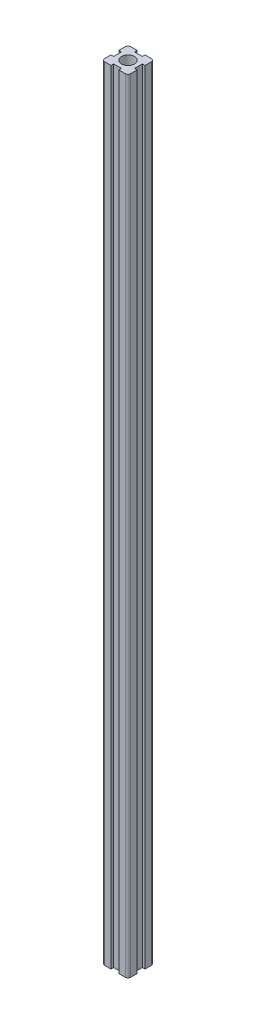
ISO-10303-21;
HEADER;
FILE_DESCRIPTION(('STEP AP214'),'2;1');
FILE_NAME('part.step','',(''),(''),'','','');
FILE_SCHEMA(('AUTOMOTIVE_DESIGN { 1 0 10303 214 1 1 1 1 }'));
ENDSEC;
DATA;
#1=APPLICATION_CONTEXT('core data for automotive mechanical design processes');
#2=APPLICATION_PROTOCOL_DEFINITION('international standard','automotive_design',2000,#1);
#3=PRODUCT_CONTEXT('',#1,'mechanical');
#4=PRODUCT('Part','Part','',(#3));
#5=PRODUCT_RELATED_PRODUCT_CATEGORY('part','',(#4));
#6=PRODUCT_DEFINITION_FORMATION('','',#4);
#7=PRODUCT_DEFINITION_CONTEXT('part definition',#1,'design');
#8=PRODUCT_DEFINITION('design','',#6,#7);
#9=PRODUCT_DEFINITION_SHAPE('','',#8);
#10=(LENGTH_UNIT() NAMED_UNIT(*) SI_UNIT(.MILLI.,.METRE.));
#11=(NAMED_UNIT(*) PLANE_ANGLE_UNIT() SI_UNIT($,.RADIAN.));
#12=(NAMED_UNIT(*) SI_UNIT($,.STERADIAN.) SOLID_ANGLE_UNIT());
#13=UNCERTAINTY_MEASURE_WITH_UNIT(LENGTH_MEASURE(1.E-05),#10,'distance_accuracy_value','');
#14=(GEOMETRIC_REPRESENTATION_CONTEXT(3) GLOBAL_UNCERTAINTY_ASSIGNED_CONTEXT((#13)) GLOBAL_UNIT_ASSIGNED_CONTEXT((#10,
#11,#12)) REPRESENTATION_CONTEXT('',''));
#15=CARTESIAN_POINT('',(0.,0.,0.));
#16=DIRECTION('',(0.,0.,1.));
#17=DIRECTION('',(1.,0.,0.));
#18=AXIS2_PLACEMENT_3D('',#15,#16,#17);
#19=CARTESIAN_POINT('',(10.,300.,-10.));
#20=DIRECTION('',(-1.,0.,0.));
#21=DIRECTION('',(0.,0.,1.));
#22=AXIS2_PLACEMENT_3D('',#19,#20,#21);
#23=PLANE('',#22);
#24=DIRECTION('',(0.,0.,-1.));
#25=VECTOR('',#24,1.);
#26=CARTESIAN_POINT('',(10.,-300.,-10.));
#27=LINE('',#26,#25);
#28=CARTESIAN_POINT('',(10.,-300.,-3.));
#29=VERTEX_POINT('',#28);
#30=CARTESIAN_POINT('',(10.,-300.,-8.00000000000001));
#31=VERTEX_POINT('',#30);
#32=EDGE_CURVE('E336',#29,#31,#27,.T.);
#33=ORIENTED_EDGE('',*,*,#32,.T.);
#34=DIRECTION('',(0.,-1.,0.));
#35=VECTOR('',#34,1.);
#36=CARTESIAN_POINT('',(10.,300.,-8.00000000000001));
#37=LINE('',#36,#35);
#38=CARTESIAN_POINT('',(10.,300.,-8.00000000000001));
#39=VERTEX_POINT('',#38);
#40=EDGE_CURVE('E435',#31,#39,#37,.F.);
#41=ORIENTED_EDGE('',*,*,#40,.T.);
#42=DIRECTION('',(0.,0.,-1.));
#43=VECTOR('',#42,1.);
#44=CARTESIAN_POINT('',(10.,300.,-10.));
#45=LINE('',#44,#43);
#46=CARTESIAN_POINT('',(10.,300.,-3.));
#47=VERTEX_POINT('',#46);
#48=EDGE_CURVE('E344',#47,#39,#45,.T.);
#49=ORIENTED_EDGE('',*,*,#48,.F.);
#50=DIRECTION('',(0.,-1.,0.));
#51=VECTOR('',#50,1.);
#52=CARTESIAN_POINT('',(10.,300.,-3.));
#53=LINE('',#52,#51);
#54=EDGE_CURVE('E397',#47,#29,#53,.T.);
#55=ORIENTED_EDGE('',*,*,#54,.T.);
#56=EDGE_LOOP('',(#33,#41,#49,#55));
#57=FACE_BOUND('',#56,.T.);
#58=ADVANCED_FACE('F39',(#57),#23,.F.);
#59=CARTESIAN_POINT('',(-9.99999999999998,300.,-10.));
#60=DIRECTION('',(0.,0.,1.));
#61=DIRECTION('',(1.,0.,0.));
#62=AXIS2_PLACEMENT_3D('',#59,#60,#61);
#63=PLANE('',#62);
#64=DIRECTION('',(-1.,0.,0.));
#65=VECTOR('',#64,1.);
#66=CARTESIAN_POINT('',(-9.99999999999998,300.,-10.));
#67=LINE('',#66,#65);
#68=CARTESIAN_POINT('',(8.00000000000001,300.,-10.));
#69=VERTEX_POINT('',#68);
#70=CARTESIAN_POINT('',(3.,300.,-10.));
#71=VERTEX_POINT('',#70);
#72=EDGE_CURVE('E345',#69,#71,#67,.T.);
#73=ORIENTED_EDGE('',*,*,#72,.F.);
#74=DIRECTION('',(0.,-1.,0.));
#75=VECTOR('',#74,1.);
#76=CARTESIAN_POINT('',(8.00000000000001,300.,-10.));
#77=LINE('',#76,#75);
#78=CARTESIAN_POINT('',(8.00000000000001,-300.,-10.));
#79=VERTEX_POINT('',#78);
#80=EDGE_CURVE('E431',#69,#79,#77,.T.);
#81=ORIENTED_EDGE('',*,*,#80,.T.);
#82=DIRECTION('',(-1.,0.,0.));
#83=VECTOR('',#82,1.);
#84=CARTESIAN_POINT('',(-9.99999999999998,-300.,-10.));
#85=LINE('',#84,#83);
#86=CARTESIAN_POINT('',(3.,-300.,-10.));
#87=VERTEX_POINT('',#86);
#88=EDGE_CURVE('E360',#79,#87,#85,.T.);
#89=ORIENTED_EDGE('',*,*,#88,.T.);
#90=DIRECTION('',(0.,1.,0.));
#91=VECTOR('',#90,1.);
#92=CARTESIAN_POINT('',(3.,300.,-10.));
#93=LINE('',#92,#91);
#94=EDGE_CURVE('E389',#87,#71,#93,.T.);
#95=ORIENTED_EDGE('',*,*,#94,.T.);
#96=EDGE_LOOP('',(#73,#81,#89,#95));
#97=FACE_BOUND('',#96,.T.);
#98=ADVANCED_FACE('F492',(#97),#63,.F.);
#99=CARTESIAN_POINT('',(-9.99999999999998,300.,-10.));
#100=DIRECTION('',(1.,0.,0.));
#101=DIRECTION('',(0.,0.,-1.));
#102=AXIS2_PLACEMENT_3D('',#99,#100,#101);
#103=PLANE('',#102);
#104=DIRECTION('',(0.,0.,1.));
#105=VECTOR('',#104,1.);
#106=CARTESIAN_POINT('',(-9.99999999999998,300.,-10.));
#107=LINE('',#106,#105);
#108=CARTESIAN_POINT('',(-9.99999999999998,300.,-8.00000000000001));
#109=VERTEX_POINT('',#108);
#110=CARTESIAN_POINT('',(-9.99999999999998,300.,-3.));
#111=VERTEX_POINT('',#110);
#112=EDGE_CURVE('E349',#109,#111,#107,.T.);
#113=ORIENTED_EDGE('',*,*,#112,.F.);
#114=DIRECTION('',(0.,-1.,0.));
#115=VECTOR('',#114,1.);
#116=CARTESIAN_POINT('',(-9.99999999999998,300.,-8.00000000000001));
#117=LINE('',#116,#115);
#118=CARTESIAN_POINT('',(-9.99999999999998,-300.,-8.00000000000001));
#119=VERTEX_POINT('',#118);
#120=EDGE_CURVE('E48',#109,#119,#117,.T.);
#121=ORIENTED_EDGE('',*,*,#120,.T.);
#122=DIRECTION('',(0.,0.,1.));
#123=VECTOR('',#122,1.);
#124=CARTESIAN_POINT('',(-9.99999999999998,-300.,-10.));
#125=LINE('',#124,#123);
#126=CARTESIAN_POINT('',(-9.99999999999998,-300.,-3.));
#127=VERTEX_POINT('',#126);
#128=EDGE_CURVE('E364',#119,#127,#125,.T.);
#129=ORIENTED_EDGE('',*,*,#128,.T.);
#130=DIRECTION('',(0.,1.,0.));
#131=VECTOR('',#130,1.);
#132=CARTESIAN_POINT('',(-9.99999999999998,300.,-3.));
#133=LINE('',#132,#131);
#134=EDGE_CURVE('E381',#127,#111,#133,.T.);
#135=ORIENTED_EDGE('',*,*,#134,.T.);
#136=EDGE_LOOP('',(#113,#121,#129,#135));
#137=FACE_BOUND('',#136,.T.);
#138=ADVANCED_FACE('F449',(#137),#103,.F.);
#139=CARTESIAN_POINT('',(-9.99999999999998,300.,10.));
#140=DIRECTION('',(0.,0.,-1.));
#141=DIRECTION('',(-1.,0.,0.));
#142=AXIS2_PLACEMENT_3D('',#139,#140,#141);
#143=PLANE('',#142);
#144=DIRECTION('',(1.,0.,0.));
#145=VECTOR('',#144,1.);
#146=CARTESIAN_POINT('',(-9.99999999999998,-300.,10.));
#147=LINE('',#146,#145);
#148=CARTESIAN_POINT('',(3.,-300.,10.));
#149=VERTEX_POINT('',#148);
#150=CARTESIAN_POINT('',(8.00000000000001,-300.,10.));
#151=VERTEX_POINT('',#150);
#152=EDGE_CURVE('E367',#149,#151,#147,.T.);
#153=ORIENTED_EDGE('',*,*,#152,.T.);
#154=DIRECTION('',(0.,-1.,0.));
#155=VECTOR('',#154,1.);
#156=CARTESIAN_POINT('',(8.00000000000001,300.,10.));
#157=LINE('',#156,#155);
#158=CARTESIAN_POINT('',(8.00000000000001,300.,10.));
#159=VERTEX_POINT('',#158);
#160=EDGE_CURVE('E417',#151,#159,#157,.F.);
#161=ORIENTED_EDGE('',*,*,#160,.T.);
#162=DIRECTION('',(1.,0.,0.));
#163=VECTOR('',#162,1.);
#164=CARTESIAN_POINT('',(-9.99999999999998,300.,10.));
#165=LINE('',#164,#163);
#166=CARTESIAN_POINT('',(3.,300.,10.));
#167=VERTEX_POINT('',#166);
#168=EDGE_CURVE('E352',#167,#159,#165,.T.);
#169=ORIENTED_EDGE('',*,*,#168,.F.);
#170=DIRECTION('',(0.,-1.,0.));
#171=VECTOR('',#170,1.);
#172=CARTESIAN_POINT('',(3.,300.,10.));
#173=LINE('',#172,#171);
#174=EDGE_CURVE('E373',#167,#149,#173,.T.);
#175=ORIENTED_EDGE('',*,*,#174,.T.);
#176=EDGE_LOOP('',(#153,#161,#169,#175));
#177=FACE_BOUND('',#176,.T.);
#178=ADVANCED_FACE('F544',(#177),#143,.F.);
#179=CARTESIAN_POINT('',(0.,300.,0.));
#180=DIRECTION('',(0.,1.,0.));
#181=DIRECTION('',(0.,0.,1.));
#182=AXIS2_PLACEMENT_3D('',#179,#180,#181);
#183=PLANE('',#182);
#184=ORIENTED_EDGE('',*,*,#168,.T.);
#185=CARTESIAN_POINT('',(8.00000000000001,300.,8.00000000000001));
#186=DIRECTION('',(0.,1.,0.));
#187=DIRECTION('',(0.,0.,1.));
#188=AXIS2_PLACEMENT_3D('',#185,#186,#187);
#189=CIRCLE('',#188,2.);
#190=CARTESIAN_POINT('',(10.,300.,8.00000000000001));
#191=VERTEX_POINT('',#190);
#192=EDGE_CURVE('E428',#159,#191,#189,.T.);
#193=ORIENTED_EDGE('',*,*,#192,.T.);
#194=CARTESIAN_POINT('',(10.,300.,3.));
#195=VERTEX_POINT('',#194);
#196=EDGE_CURVE('E340',#191,#195,#45,.T.);
#197=ORIENTED_EDGE('',*,*,#196,.T.);
#198=DIRECTION('',(-1.,0.,0.));
#199=VECTOR('',#198,1.);
#200=CARTESIAN_POINT('',(8.,300.,3.));
#201=LINE('',#200,#199);
#202=CARTESIAN_POINT('',(8.,300.,3.));
#203=VERTEX_POINT('',#202);
#204=EDGE_CURVE('E246',#195,#203,#201,.T.);
#205=ORIENTED_EDGE('',*,*,#204,.T.);
#206=DIRECTION('',(0.,0.,-1.));
#207=VECTOR('',#206,1.);
#208=CARTESIAN_POINT('',(8.,300.,3.));
#209=LINE('',#208,#207);
#210=CARTESIAN_POINT('',(8.,300.,-3.));
#211=VERTEX_POINT('',#210);
#212=EDGE_CURVE('E250',#203,#211,#209,.T.);
#213=ORIENTED_EDGE('',*,*,#212,.T.);
#214=DIRECTION('',(1.,0.,0.));
#215=VECTOR('',#214,1.);
#216=CARTESIAN_POINT('',(8.,300.,-3.));
#217=LINE('',#216,#215);
#218=EDGE_CURVE('E255',#211,#47,#217,.T.);
#219=ORIENTED_EDGE('',*,*,#218,.T.);
#220=ORIENTED_EDGE('',*,*,#48,.T.);
#221=CARTESIAN_POINT('',(8.00000000000001,300.,-8.00000000000001));
#222=DIRECTION('',(0.,1.,0.));
#223=DIRECTION('',(0.,0.,1.));
#224=AXIS2_PLACEMENT_3D('',#221,#222,#223);
#225=CIRCLE('',#224,2.);
#226=EDGE_CURVE('E425',#39,#69,#225,.T.);
#227=ORIENTED_EDGE('',*,*,#226,.T.);
#228=ORIENTED_EDGE('',*,*,#72,.T.);
#229=DIRECTION('',(0.,0.,1.));
#230=VECTOR('',#229,1.);
#231=CARTESIAN_POINT('',(3.,300.,-8.00000000000001));
#232=LINE('',#231,#230);
#233=CARTESIAN_POINT('',(3.,300.,-8.00000000000001));
#234=VERTEX_POINT('',#233);
#235=EDGE_CURVE('E275',#71,#234,#232,.T.);
#236=ORIENTED_EDGE('',*,*,#235,.T.);
#237=DIRECTION('',(-1.,0.,0.));
#238=VECTOR('',#237,1.);
#239=CARTESIAN_POINT('',(-3.,300.,-8.00000000000001));
#240=LINE('',#239,#238);
#241=CARTESIAN_POINT('',(-3.,300.,-8.00000000000001));
#242=VERTEX_POINT('',#241);
#243=EDGE_CURVE('E279',#234,#242,#240,.T.);
#244=ORIENTED_EDGE('',*,*,#243,.T.);
#245=DIRECTION('',(0.,0.,-1.));
#246=VECTOR('',#245,1.);
#247=CARTESIAN_POINT('',(-3.,300.,-8.00000000000001));
#248=LINE('',#247,#246);
#249=CARTESIAN_POINT('',(-3.,300.,-10.));
#250=VERTEX_POINT('',#249);
#251=EDGE_CURVE('E284',#242,#250,#248,.T.);
#252=ORIENTED_EDGE('',*,*,#251,.T.);
#253=CARTESIAN_POINT('',(-7.99999999999998,300.,-10.));
#254=VERTEX_POINT('',#253);
#255=EDGE_CURVE('E343',#250,#254,#67,.T.);
#256=ORIENTED_EDGE('',*,*,#255,.T.);
#257=CARTESIAN_POINT('',(-7.99999999999998,300.,-8.00000000000001));
#258=DIRECTION('',(0.,1.,0.));
#259=DIRECTION('',(0.,0.,1.));
#260=AXIS2_PLACEMENT_3D('',#257,#258,#259);
#261=CIRCLE('',#260,2.);
#262=EDGE_CURVE('E420',#254,#109,#261,.T.);
#263=ORIENTED_EDGE('',*,*,#262,.T.);
#264=ORIENTED_EDGE('',*,*,#112,.T.);
#265=DIRECTION('',(1.,0.,0.));
#266=VECTOR('',#265,1.);
#267=CARTESIAN_POINT('',(-12.,300.,-3.));
#268=LINE('',#267,#266);
#269=CARTESIAN_POINT('',(-7.99999999999998,300.,-3.));
#270=VERTEX_POINT('',#269);
#271=EDGE_CURVE('E313',#111,#270,#268,.T.);
#272=ORIENTED_EDGE('',*,*,#271,.T.);
#273=DIRECTION('',(0.,0.,1.));
#274=VECTOR('',#273,1.);
#275=CARTESIAN_POINT('',(-7.99999999999998,300.,3.));
#276=LINE('',#275,#274);
#277=CARTESIAN_POINT('',(-7.99999999999998,300.,3.));
#278=VERTEX_POINT('',#277);
#279=EDGE_CURVE('E304',#270,#278,#276,.T.);
#280=ORIENTED_EDGE('',*,*,#279,.T.);
#281=DIRECTION('',(-1.,0.,0.));
#282=VECTOR('',#281,1.);
#283=CARTESIAN_POINT('',(-12.,300.,3.));
#284=LINE('',#283,#282);
#285=CARTESIAN_POINT('',(-9.99999999999998,300.,3.));
#286=VERTEX_POINT('',#285);
#287=EDGE_CURVE('E308',#278,#286,#284,.T.);
#288=ORIENTED_EDGE('',*,*,#287,.T.);
#289=CARTESIAN_POINT('',(-9.99999999999998,300.,8.00000000000001));
#290=VERTEX_POINT('',#289);
#291=EDGE_CURVE('E348',#286,#290,#107,.T.);
#292=ORIENTED_EDGE('',*,*,#291,.T.);
#293=CARTESIAN_POINT('',(-7.99999999999998,300.,8.00000000000001));
#294=DIRECTION('',(0.,1.,0.));
#295=DIRECTION('',(0.,0.,1.));
#296=AXIS2_PLACEMENT_3D('',#293,#294,#295);
#297=CIRCLE('',#296,2.);
#298=CARTESIAN_POINT('',(-7.99999999999998,300.,10.));
#299=VERTEX_POINT('',#298);
#300=EDGE_CURVE('E55',#290,#299,#297,.T.);
#301=ORIENTED_EDGE('',*,*,#300,.T.);
#302=CARTESIAN_POINT('',(-3.,300.,10.));
#303=VERTEX_POINT('',#302);
#304=EDGE_CURVE('E227',#299,#303,#165,.T.);
#305=ORIENTED_EDGE('',*,*,#304,.T.);
#306=DIRECTION('',(0.,0.,-1.));
#307=VECTOR('',#306,1.);
#308=CARTESIAN_POINT('',(-3.,300.,12.));
#309=LINE('',#308,#307);
#310=CARTESIAN_POINT('',(-3.,300.,8.00000000000001));
#311=VERTEX_POINT('',#310);
#312=EDGE_CURVE('E207',#303,#311,#309,.T.);
#313=ORIENTED_EDGE('',*,*,#312,.T.);
#314=DIRECTION('',(1.,0.,0.));
#315=VECTOR('',#314,1.);
#316=CARTESIAN_POINT('',(-3.,300.,8.00000000000001));
#317=LINE('',#316,#315);
#318=CARTESIAN_POINT('',(3.,300.,8.00000000000001));
#319=VERTEX_POINT('',#318);
#320=EDGE_CURVE('E216',#311,#319,#317,.T.);
#321=ORIENTED_EDGE('',*,*,#320,.T.);
#322=DIRECTION('',(0.,0.,1.));
#323=VECTOR('',#322,1.);
#324=CARTESIAN_POINT('',(3.,300.,12.));
#325=LINE('',#324,#323);
#326=EDGE_CURVE('E229',#319,#167,#325,.T.);
#327=ORIENTED_EDGE('',*,*,#326,.T.);
#328=EDGE_LOOP('',(#184,#193,#197,#205,#213,#219,#220,#227,#228,#236,#244,#252,#256,#263,#264,
#272,#280,#288,#292,#301,#305,#313,#321,#327));
#329=FACE_BOUND('',#328,.T.);
#330=CARTESIAN_POINT('',(0.,300.,0.));
#331=DIRECTION('',(0.,1.,0.));
#332=DIRECTION('',(0.,0.,1.));
#333=AXIS2_PLACEMENT_3D('',#330,#331,#332);
#334=CIRCLE('',#333,5.);
#335=CARTESIAN_POINT('',(0.,300.,5.));
#336=VERTEX_POINT('',#335);
#337=EDGE_CURVE('E332',#336,#336,#334,.T.);
#338=ORIENTED_EDGE('',*,*,#337,.F.);
#339=EDGE_LOOP('',(#338));
#340=FACE_BOUND('',#339,.T.);
#341=ADVANCED_FACE('F225',(#329,#340),#183,.T.);
#342=CARTESIAN_POINT('',(0.,-300.,0.));
#343=DIRECTION('',(0.,1.,0.));
#344=DIRECTION('',(0.,0.,1.));
#345=AXIS2_PLACEMENT_3D('',#342,#343,#344);
#346=PLANE('',#345);
#347=CARTESIAN_POINT('',(10.,-300.,8.00000000000001));
#348=VERTEX_POINT('',#347);
#349=CARTESIAN_POINT('',(10.,-300.,3.));
#350=VERTEX_POINT('',#349);
#351=EDGE_CURVE('E356',#348,#350,#27,.T.);
#352=ORIENTED_EDGE('',*,*,#351,.F.);
#353=CARTESIAN_POINT('',(8.00000000000001,-300.,8.00000000000001));
#354=DIRECTION('',(0.,1.,0.));
#355=DIRECTION('',(0.,0.,1.));
#356=AXIS2_PLACEMENT_3D('',#353,#354,#355);
#357=CIRCLE('',#356,2.);
#358=EDGE_CURVE('E414',#348,#151,#357,.F.);
#359=ORIENTED_EDGE('',*,*,#358,.T.);
#360=ORIENTED_EDGE('',*,*,#152,.F.);
#361=DIRECTION('',(0.,0.,1.));
#362=VECTOR('',#361,1.);
#363=CARTESIAN_POINT('',(3.,-300.,12.));
#364=LINE('',#363,#362);
#365=CARTESIAN_POINT('',(3.,-300.,8.00000000000001));
#366=VERTEX_POINT('',#365);
#367=EDGE_CURVE('E235',#366,#149,#364,.T.);
#368=ORIENTED_EDGE('',*,*,#367,.F.);
#369=DIRECTION('',(1.,0.,0.));
#370=VECTOR('',#369,1.);
#371=CARTESIAN_POINT('',(-3.,-300.,8.00000000000001));
#372=LINE('',#371,#370);
#373=CARTESIAN_POINT('',(-3.,-300.,8.00000000000001));
#374=VERTEX_POINT('',#373);
#375=EDGE_CURVE('E232',#374,#366,#372,.T.);
#376=ORIENTED_EDGE('',*,*,#375,.F.);
#377=DIRECTION('',(0.,0.,-1.));
#378=VECTOR('',#377,1.);
#379=CARTESIAN_POINT('',(-3.,-300.,12.));
#380=LINE('',#379,#378);
#381=CARTESIAN_POINT('',(-3.,-300.,10.));
#382=VERTEX_POINT('',#381);
#383=EDGE_CURVE('E210',#382,#374,#380,.T.);
#384=ORIENTED_EDGE('',*,*,#383,.F.);
#385=CARTESIAN_POINT('',(-7.99999999999998,-300.,10.));
#386=VERTEX_POINT('',#385);
#387=EDGE_CURVE('E368',#386,#382,#147,.T.);
#388=ORIENTED_EDGE('',*,*,#387,.F.);
#389=CARTESIAN_POINT('',(-7.99999999999998,-300.,8.00000000000001));
#390=DIRECTION('',(0.,1.,0.));
#391=DIRECTION('',(0.,0.,1.));
#392=AXIS2_PLACEMENT_3D('',#389,#390,#391);
#393=CIRCLE('',#392,2.);
#394=CARTESIAN_POINT('',(-9.99999999999998,-300.,8.00000000000001));
#395=VERTEX_POINT('',#394);
#396=EDGE_CURVE('E408',#386,#395,#393,.F.);
#397=ORIENTED_EDGE('',*,*,#396,.T.);
#398=CARTESIAN_POINT('',(-9.99999999999998,-300.,3.));
#399=VERTEX_POINT('',#398);
#400=EDGE_CURVE('E363',#399,#395,#125,.T.);
#401=ORIENTED_EDGE('',*,*,#400,.F.);
#402=DIRECTION('',(-1.,0.,0.));
#403=VECTOR('',#402,1.);
#404=CARTESIAN_POINT('',(-12.,-300.,3.));
#405=LINE('',#404,#403);
#406=CARTESIAN_POINT('',(-7.99999999999998,-300.,3.));
#407=VERTEX_POINT('',#406);
#408=EDGE_CURVE('E322',#407,#399,#405,.T.);
#409=ORIENTED_EDGE('',*,*,#408,.F.);
#410=DIRECTION('',(0.,0.,1.));
#411=VECTOR('',#410,1.);
#412=CARTESIAN_POINT('',(-7.99999999999998,-300.,3.));
#413=LINE('',#412,#411);
#414=CARTESIAN_POINT('',(-7.99999999999998,-300.,-3.));
#415=VERTEX_POINT('',#414);
#416=EDGE_CURVE('E318',#415,#407,#413,.T.);
#417=ORIENTED_EDGE('',*,*,#416,.F.);
#418=DIRECTION('',(1.,0.,0.));
#419=VECTOR('',#418,1.);
#420=CARTESIAN_POINT('',(-12.,-300.,-3.));
#421=LINE('',#420,#419);
#422=EDGE_CURVE('E309',#127,#415,#421,.T.);
#423=ORIENTED_EDGE('',*,*,#422,.F.);
#424=ORIENTED_EDGE('',*,*,#128,.F.);
#425=CARTESIAN_POINT('',(-7.99999999999998,-300.,-8.00000000000001));
#426=DIRECTION('',(0.,1.,0.));
#427=DIRECTION('',(0.,0.,1.));
#428=AXIS2_PLACEMENT_3D('',#425,#426,#427);
#429=CIRCLE('',#428,2.);
#430=CARTESIAN_POINT('',(-7.99999999999998,-300.,-10.));
#431=VERTEX_POINT('',#430);
#432=EDGE_CURVE('E405',#119,#431,#429,.F.);
#433=ORIENTED_EDGE('',*,*,#432,.T.);
#434=CARTESIAN_POINT('',(-3.,-300.,-10.));
#435=VERTEX_POINT('',#434);
#436=EDGE_CURVE('E359',#435,#431,#85,.T.);
#437=ORIENTED_EDGE('',*,*,#436,.F.);
#438=DIRECTION('',(0.,0.,-1.));
#439=VECTOR('',#438,1.);
#440=CARTESIAN_POINT('',(-3.,-300.,-8.00000000000001));
#441=LINE('',#440,#439);
#442=CARTESIAN_POINT('',(-3.,-300.,-8.00000000000001));
#443=VERTEX_POINT('',#442);
#444=EDGE_CURVE('E280',#443,#435,#441,.T.);
#445=ORIENTED_EDGE('',*,*,#444,.F.);
#446=DIRECTION('',(-1.,0.,0.));
#447=VECTOR('',#446,1.);
#448=CARTESIAN_POINT('',(-3.,-300.,-8.00000000000001));
#449=LINE('',#448,#447);
#450=CARTESIAN_POINT('',(3.,-300.,-8.00000000000001));
#451=VERTEX_POINT('',#450);
#452=EDGE_CURVE('E292',#451,#443,#449,.T.);
#453=ORIENTED_EDGE('',*,*,#452,.F.);
#454=DIRECTION('',(0.,0.,1.));
#455=VECTOR('',#454,1.);
#456=CARTESIAN_POINT('',(3.,-300.,-8.00000000000001));
#457=LINE('',#456,#455);
#458=EDGE_CURVE('E289',#87,#451,#457,.T.);
#459=ORIENTED_EDGE('',*,*,#458,.F.);
#460=ORIENTED_EDGE('',*,*,#88,.F.);
#461=CARTESIAN_POINT('',(8.00000000000001,-300.,-8.00000000000001));
#462=DIRECTION('',(0.,1.,0.));
#463=DIRECTION('',(0.,0.,1.));
#464=AXIS2_PLACEMENT_3D('',#461,#462,#463);
#465=CIRCLE('',#464,2.);
#466=EDGE_CURVE('E411',#79,#31,#465,.F.);
#467=ORIENTED_EDGE('',*,*,#466,.T.);
#468=ORIENTED_EDGE('',*,*,#32,.F.);
#469=DIRECTION('',(1.,0.,0.));
#470=VECTOR('',#469,1.);
#471=CARTESIAN_POINT('',(8.,-300.,-3.));
#472=LINE('',#471,#470);
#473=CARTESIAN_POINT('',(8.,-300.,-3.));
#474=VERTEX_POINT('',#473);
#475=EDGE_CURVE('E251',#474,#29,#472,.T.);
#476=ORIENTED_EDGE('',*,*,#475,.F.);
#477=DIRECTION('',(0.,0.,-1.));
#478=VECTOR('',#477,1.);
#479=CARTESIAN_POINT('',(8.,-300.,3.));
#480=LINE('',#479,#478);
#481=CARTESIAN_POINT('',(8.,-300.,3.));
#482=VERTEX_POINT('',#481);
#483=EDGE_CURVE('E263',#482,#474,#480,.T.);
#484=ORIENTED_EDGE('',*,*,#483,.F.);
#485=DIRECTION('',(-1.,0.,0.));
#486=VECTOR('',#485,1.);
#487=CARTESIAN_POINT('',(8.,-300.,3.));
#488=LINE('',#487,#486);
#489=EDGE_CURVE('E260',#350,#482,#488,.T.);
#490=ORIENTED_EDGE('',*,*,#489,.F.);
#491=EDGE_LOOP('',(#352,#359,#360,#368,#376,#384,#388,#397,#401,#409,#417,#423,#424,#433,#437,
#445,#453,#459,#460,#467,#468,#476,#484,#490));
#492=FACE_BOUND('',#491,.T.);
#493=CARTESIAN_POINT('',(0.,-300.,0.));
#494=DIRECTION('',(0.,1.,0.));
#495=DIRECTION('',(0.,0.,1.));
#496=AXIS2_PLACEMENT_3D('',#493,#494,#495);
#497=CIRCLE('',#496,5.);
#498=CARTESIAN_POINT('',(0.,-300.,5.));
#499=VERTEX_POINT('',#498);
#500=EDGE_CURVE('E244',#499,#499,#497,.T.);
#501=ORIENTED_EDGE('',*,*,#500,.T.);
#502=EDGE_LOOP('',(#501));
#503=FACE_BOUND('',#502,.T.);
#504=ADVANCED_FACE('F456',(#492,#503),#346,.F.);
#505=ORIENTED_EDGE('',*,*,#196,.F.);
#506=DIRECTION('',(0.,-1.,0.));
#507=VECTOR('',#506,1.);
#508=CARTESIAN_POINT('',(10.,300.,8.00000000000001));
#509=LINE('',#508,#507);
#510=EDGE_CURVE('E401',#191,#348,#509,.T.);
#511=ORIENTED_EDGE('',*,*,#510,.T.);
#512=ORIENTED_EDGE('',*,*,#351,.T.);
#513=DIRECTION('',(0.,1.,0.));
#514=VECTOR('',#513,1.);
#515=CARTESIAN_POINT('',(10.,300.,3.));
#516=LINE('',#515,#514);
#517=EDGE_CURVE('E393',#350,#195,#516,.T.);
#518=ORIENTED_EDGE('',*,*,#517,.T.);
#519=EDGE_LOOP('',(#505,#511,#512,#518));
#520=FACE_BOUND('',#519,.T.);
#521=ADVANCED_FACE('F517',(#520),#23,.F.);
#522=ORIENTED_EDGE('',*,*,#436,.T.);
#523=DIRECTION('',(0.,-1.,0.));
#524=VECTOR('',#523,1.);
#525=CARTESIAN_POINT('',(-7.99999999999998,300.,-10.));
#526=LINE('',#525,#524);
#527=EDGE_CURVE('E11',#431,#254,#526,.F.);
#528=ORIENTED_EDGE('',*,*,#527,.T.);
#529=ORIENTED_EDGE('',*,*,#255,.F.);
#530=DIRECTION('',(0.,-1.,0.));
#531=VECTOR('',#530,1.);
#532=CARTESIAN_POINT('',(-3.,300.,-10.));
#533=LINE('',#532,#531);
#534=EDGE_CURVE('E385',#250,#435,#533,.T.);
#535=ORIENTED_EDGE('',*,*,#534,.T.);
#536=EDGE_LOOP('',(#522,#528,#529,#535));
#537=FACE_BOUND('',#536,.T.);
#538=ADVANCED_FACE('F473',(#537),#63,.F.);
#539=ORIENTED_EDGE('',*,*,#400,.T.);
#540=DIRECTION('',(0.,-1.,0.));
#541=VECTOR('',#540,1.);
#542=CARTESIAN_POINT('',(-9.99999999999998,300.,8.00000000000001));
#543=LINE('',#542,#541);
#544=EDGE_CURVE('E63',#395,#290,#543,.F.);
#545=ORIENTED_EDGE('',*,*,#544,.T.);
#546=ORIENTED_EDGE('',*,*,#291,.F.);
#547=DIRECTION('',(0.,-1.,0.));
#548=VECTOR('',#547,1.);
#549=CARTESIAN_POINT('',(-9.99999999999998,300.,3.));
#550=LINE('',#549,#548);
#551=EDGE_CURVE('E377',#286,#399,#550,.T.);
#552=ORIENTED_EDGE('',*,*,#551,.T.);
#553=EDGE_LOOP('',(#539,#545,#546,#552));
#554=FACE_BOUND('',#553,.T.);
#555=ADVANCED_FACE('F529',(#554),#103,.F.);
#556=ORIENTED_EDGE('',*,*,#304,.F.);
#557=DIRECTION('',(0.,-1.,0.));
#558=VECTOR('',#557,1.);
#559=CARTESIAN_POINT('',(-7.99999999999998,300.,10.));
#560=LINE('',#559,#558);
#561=EDGE_CURVE('E438',#299,#386,#560,.T.);
#562=ORIENTED_EDGE('',*,*,#561,.T.);
#563=ORIENTED_EDGE('',*,*,#387,.T.);
#564=DIRECTION('',(0.,1.,0.));
#565=VECTOR('',#564,1.);
#566=CARTESIAN_POINT('',(-3.,300.,10.));
#567=LINE('',#566,#565);
#568=EDGE_CURVE('E355',#382,#303,#567,.T.);
#569=ORIENTED_EDGE('',*,*,#568,.T.);
#570=EDGE_LOOP('',(#556,#562,#563,#569));
#571=FACE_BOUND('',#570,.T.);
#572=ADVANCED_FACE('F554',(#571),#143,.F.);
#573=CARTESIAN_POINT('',(0.,300.,0.));
#574=DIRECTION('',(0.,-1.,0.));
#575=DIRECTION('',(0.,0.,-1.));
#576=AXIS2_PLACEMENT_3D('',#573,#574,#575);
#577=CYLINDRICAL_SURFACE('',#576,5.);
#578=ORIENTED_EDGE('',*,*,#337,.T.);
#579=EDGE_LOOP('',(#578));
#580=FACE_BOUND('',#579,.T.);
#581=ORIENTED_EDGE('',*,*,#500,.F.);
#582=EDGE_LOOP('',(#581));
#583=FACE_BOUND('',#582,.T.);
#584=ADVANCED_FACE('F571',(#580,#583),#577,.F.);
#585=CARTESIAN_POINT('',(3.,300.,12.));
#586=DIRECTION('',(1.,0.,0.));
#587=DIRECTION('',(0.,0.,-1.));
#588=AXIS2_PLACEMENT_3D('',#585,#586,#587);
#589=PLANE('',#588);
#590=ORIENTED_EDGE('',*,*,#326,.F.);
#591=DIRECTION('',(0.,-1.,0.));
#592=VECTOR('',#591,1.);
#593=CARTESIAN_POINT('',(3.,300.,8.00000000000001));
#594=LINE('',#593,#592);
#595=EDGE_CURVE('E215',#319,#366,#594,.T.);
#596=ORIENTED_EDGE('',*,*,#595,.T.);
#597=ORIENTED_EDGE('',*,*,#367,.T.);
#598=ORIENTED_EDGE('',*,*,#174,.F.);
#599=EDGE_LOOP('',(#590,#596,#597,#598));
#600=FACE_BOUND('',#599,.T.);
#601=ADVANCED_FACE('F556',(#600),#589,.F.);
#602=CARTESIAN_POINT('',(-3.,300.,12.));
#603=DIRECTION('',(-1.,0.,0.));
#604=DIRECTION('',(0.,0.,1.));
#605=AXIS2_PLACEMENT_3D('',#602,#603,#604);
#606=PLANE('',#605);
#607=ORIENTED_EDGE('',*,*,#383,.T.);
#608=DIRECTION('',(0.,-1.,0.));
#609=VECTOR('',#608,1.);
#610=CARTESIAN_POINT('',(-3.,300.,8.00000000000001));
#611=LINE('',#610,#609);
#612=EDGE_CURVE('E202',#311,#374,#611,.T.);
#613=ORIENTED_EDGE('',*,*,#612,.F.);
#614=ORIENTED_EDGE('',*,*,#312,.F.);
#615=ORIENTED_EDGE('',*,*,#568,.F.);
#616=EDGE_LOOP('',(#607,#613,#614,#615));
#617=FACE_BOUND('',#616,.T.);
#618=ADVANCED_FACE('F204',(#617),#606,.F.);
#619=CARTESIAN_POINT('',(-3.,300.,8.00000000000001));
#620=DIRECTION('',(0.,0.,-1.));
#621=DIRECTION('',(-1.,0.,0.));
#622=AXIS2_PLACEMENT_3D('',#619,#620,#621);
#623=PLANE('',#622);
#624=ORIENTED_EDGE('',*,*,#375,.T.);
#625=ORIENTED_EDGE('',*,*,#595,.F.);
#626=ORIENTED_EDGE('',*,*,#320,.F.);
#627=ORIENTED_EDGE('',*,*,#612,.T.);
#628=EDGE_LOOP('',(#624,#625,#626,#627));
#629=FACE_BOUND('',#628,.T.);
#630=ADVANCED_FACE('F219',(#629),#623,.F.);
#631=CARTESIAN_POINT('',(-12.,300.,-3.));
#632=DIRECTION('',(0.,0.,-1.));
#633=DIRECTION('',(-1.,0.,0.));
#634=AXIS2_PLACEMENT_3D('',#631,#632,#633);
#635=PLANE('',#634);
#636=ORIENTED_EDGE('',*,*,#422,.T.);
#637=DIRECTION('',(0.,-1.,0.));
#638=VECTOR('',#637,1.);
#639=CARTESIAN_POINT('',(-7.99999999999998,300.,-3.));
#640=LINE('',#639,#638);
#641=EDGE_CURVE('E293',#270,#415,#640,.T.);
#642=ORIENTED_EDGE('',*,*,#641,.F.);
#643=ORIENTED_EDGE('',*,*,#271,.F.);
#644=ORIENTED_EDGE('',*,*,#134,.F.);
#645=EDGE_LOOP('',(#636,#642,#643,#644));
#646=FACE_BOUND('',#645,.T.);
#647=ADVANCED_FACE('F463',(#646),#635,.F.);
#648=CARTESIAN_POINT('',(-12.,300.,3.));
#649=DIRECTION('',(0.,0.,1.));
#650=DIRECTION('',(1.,0.,0.));
#651=AXIS2_PLACEMENT_3D('',#648,#649,#650);
#652=PLANE('',#651);
#653=ORIENTED_EDGE('',*,*,#287,.F.);
#654=DIRECTION('',(0.,-1.,0.));
#655=VECTOR('',#654,1.);
#656=CARTESIAN_POINT('',(-7.99999999999998,300.,3.));
#657=LINE('',#656,#655);
#658=EDGE_CURVE('E317',#278,#407,#657,.T.);
#659=ORIENTED_EDGE('',*,*,#658,.T.);
#660=ORIENTED_EDGE('',*,*,#408,.T.);
#661=ORIENTED_EDGE('',*,*,#551,.F.);
#662=EDGE_LOOP('',(#653,#659,#660,#661));
#663=FACE_BOUND('',#662,.T.);
#664=ADVANCED_FACE('F561',(#663),#652,.F.);
#665=CARTESIAN_POINT('',(-7.99999999999998,300.,3.));
#666=DIRECTION('',(1.,0.,0.));
#667=DIRECTION('',(0.,0.,-1.));
#668=AXIS2_PLACEMENT_3D('',#665,#666,#667);
#669=PLANE('',#668);
#670=ORIENTED_EDGE('',*,*,#416,.T.);
#671=ORIENTED_EDGE('',*,*,#658,.F.);
#672=ORIENTED_EDGE('',*,*,#279,.F.);
#673=ORIENTED_EDGE('',*,*,#641,.T.);
#674=EDGE_LOOP('',(#670,#671,#672,#673));
#675=FACE_BOUND('',#674,.T.);
#676=ADVANCED_FACE('F467',(#675),#669,.F.);
#677=CARTESIAN_POINT('',(3.,300.,-8.00000000000001));
#678=DIRECTION('',(1.,0.,0.));
#679=DIRECTION('',(0.,0.,-1.));
#680=AXIS2_PLACEMENT_3D('',#677,#678,#679);
#681=PLANE('',#680);
#682=ORIENTED_EDGE('',*,*,#458,.T.);
#683=DIRECTION('',(0.,-1.,0.));
#684=VECTOR('',#683,1.);
#685=CARTESIAN_POINT('',(3.,300.,-8.00000000000001));
#686=LINE('',#685,#684);
#687=EDGE_CURVE('E288',#234,#451,#686,.T.);
#688=ORIENTED_EDGE('',*,*,#687,.F.);
#689=ORIENTED_EDGE('',*,*,#235,.F.);
#690=ORIENTED_EDGE('',*,*,#94,.F.);
#691=EDGE_LOOP('',(#682,#688,#689,#690));
#692=FACE_BOUND('',#691,.T.);
#693=ADVANCED_FACE('F497',(#692),#681,.F.);
#694=CARTESIAN_POINT('',(-3.,300.,-8.00000000000001));
#695=DIRECTION('',(-1.,0.,0.));
#696=DIRECTION('',(0.,0.,1.));
#697=AXIS2_PLACEMENT_3D('',#694,#695,#696);
#698=PLANE('',#697);
#699=ORIENTED_EDGE('',*,*,#251,.F.);
#700=DIRECTION('',(0.,-1.,0.));
#701=VECTOR('',#700,1.);
#702=CARTESIAN_POINT('',(-3.,300.,-8.00000000000001));
#703=LINE('',#702,#701);
#704=EDGE_CURVE('E264',#242,#443,#703,.T.);
#705=ORIENTED_EDGE('',*,*,#704,.T.);
#706=ORIENTED_EDGE('',*,*,#444,.T.);
#707=ORIENTED_EDGE('',*,*,#534,.F.);
#708=EDGE_LOOP('',(#699,#705,#706,#707));
#709=FACE_BOUND('',#708,.T.);
#710=ADVANCED_FACE('F504',(#709),#698,.F.);
#711=CARTESIAN_POINT('',(-3.,300.,-8.00000000000001));
#712=DIRECTION('',(0.,0.,1.));
#713=DIRECTION('',(1.,0.,0.));
#714=AXIS2_PLACEMENT_3D('',#711,#712,#713);
#715=PLANE('',#714);
#716=ORIENTED_EDGE('',*,*,#452,.T.);
#717=ORIENTED_EDGE('',*,*,#704,.F.);
#718=ORIENTED_EDGE('',*,*,#243,.F.);
#719=ORIENTED_EDGE('',*,*,#687,.T.);
#720=EDGE_LOOP('',(#716,#717,#718,#719));
#721=FACE_BOUND('',#720,.T.);
#722=ADVANCED_FACE('F500',(#721),#715,.F.);
#723=CARTESIAN_POINT('',(8.,300.,-3.));
#724=DIRECTION('',(0.,0.,-1.));
#725=DIRECTION('',(-1.,0.,0.));
#726=AXIS2_PLACEMENT_3D('',#723,#724,#725);
#727=PLANE('',#726);
#728=ORIENTED_EDGE('',*,*,#218,.F.);
#729=DIRECTION('',(0.,-1.,0.));
#730=VECTOR('',#729,1.);
#731=CARTESIAN_POINT('',(8.,300.,-3.));
#732=LINE('',#731,#730);
#733=EDGE_CURVE('E238',#211,#474,#732,.T.);
#734=ORIENTED_EDGE('',*,*,#733,.T.);
#735=ORIENTED_EDGE('',*,*,#475,.T.);
#736=ORIENTED_EDGE('',*,*,#54,.F.);
#737=EDGE_LOOP('',(#728,#734,#735,#736));
#738=FACE_BOUND('',#737,.T.);
#739=ADVANCED_FACE('F511',(#738),#727,.F.);
#740=CARTESIAN_POINT('',(8.,300.,3.));
#741=DIRECTION('',(0.,0.,1.));
#742=DIRECTION('',(1.,0.,0.));
#743=AXIS2_PLACEMENT_3D('',#740,#741,#742);
#744=PLANE('',#743);
#745=ORIENTED_EDGE('',*,*,#489,.T.);
#746=DIRECTION('',(0.,-1.,0.));
#747=VECTOR('',#746,1.);
#748=CARTESIAN_POINT('',(8.,300.,3.));
#749=LINE('',#748,#747);
#750=EDGE_CURVE('E259',#203,#482,#749,.T.);
#751=ORIENTED_EDGE('',*,*,#750,.F.);
#752=ORIENTED_EDGE('',*,*,#204,.F.);
#753=ORIENTED_EDGE('',*,*,#517,.F.);
#754=EDGE_LOOP('',(#745,#751,#752,#753));
#755=FACE_BOUND('',#754,.T.);
#756=ADVANCED_FACE('F656',(#755),#744,.F.);
#757=CARTESIAN_POINT('',(8.,300.,3.));
#758=DIRECTION('',(-1.,0.,0.));
#759=DIRECTION('',(0.,0.,1.));
#760=AXIS2_PLACEMENT_3D('',#757,#758,#759);
#761=PLANE('',#760);
#762=ORIENTED_EDGE('',*,*,#483,.T.);
#763=ORIENTED_EDGE('',*,*,#733,.F.);
#764=ORIENTED_EDGE('',*,*,#212,.F.);
#765=ORIENTED_EDGE('',*,*,#750,.T.);
#766=EDGE_LOOP('',(#762,#763,#764,#765));
#767=FACE_BOUND('',#766,.T.);
#768=ADVANCED_FACE('F626',(#767),#761,.F.);
#769=CARTESIAN_POINT('',(8.00000000000001,300.,8.00000000000001));
#770=DIRECTION('',(0.,-1.,0.));
#771=DIRECTION('',(0.,0.,-1.));
#772=AXIS2_PLACEMENT_3D('',#769,#770,#771);
#773=CYLINDRICAL_SURFACE('',#772,2.);
#774=ORIENTED_EDGE('',*,*,#192,.F.);
#775=ORIENTED_EDGE('',*,*,#160,.F.);
#776=ORIENTED_EDGE('',*,*,#358,.F.);
#777=ORIENTED_EDGE('',*,*,#510,.F.);
#778=EDGE_LOOP('',(#774,#775,#776,#777));
#779=FACE_BOUND('',#778,.T.);
#780=ADVANCED_FACE('F537',(#779),#773,.T.);
#781=CARTESIAN_POINT('',(8.00000000000001,300.,-8.00000000000001));
#782=DIRECTION('',(0.,-1.,0.));
#783=DIRECTION('',(0.,0.,-1.));
#784=AXIS2_PLACEMENT_3D('',#781,#782,#783);
#785=CYLINDRICAL_SURFACE('',#784,2.);
#786=ORIENTED_EDGE('',*,*,#226,.F.);
#787=ORIENTED_EDGE('',*,*,#40,.F.);
#788=ORIENTED_EDGE('',*,*,#466,.F.);
#789=ORIENTED_EDGE('',*,*,#80,.F.);
#790=EDGE_LOOP('',(#786,#787,#788,#789));
#791=FACE_BOUND('',#790,.T.);
#792=ADVANCED_FACE('F487',(#791),#785,.T.);
#793=CARTESIAN_POINT('',(-7.99999999999998,300.,8.00000000000001));
#794=DIRECTION('',(0.,-1.,0.));
#795=DIRECTION('',(0.,0.,-1.));
#796=AXIS2_PLACEMENT_3D('',#793,#794,#795);
#797=CYLINDRICAL_SURFACE('',#796,2.);
#798=ORIENTED_EDGE('',*,*,#300,.F.);
#799=ORIENTED_EDGE('',*,*,#544,.F.);
#800=ORIENTED_EDGE('',*,*,#396,.F.);
#801=ORIENTED_EDGE('',*,*,#561,.F.);
#802=EDGE_LOOP('',(#798,#799,#800,#801));
#803=FACE_BOUND('',#802,.T.);
#804=ADVANCED_FACE('F550',(#803),#797,.T.);
#805=CARTESIAN_POINT('',(-7.99999999999998,300.,-8.00000000000001));
#806=DIRECTION('',(0.,-1.,0.));
#807=DIRECTION('',(0.,0.,-1.));
#808=AXIS2_PLACEMENT_3D('',#805,#806,#807);
#809=CYLINDRICAL_SURFACE('',#808,2.);
#810=ORIENTED_EDGE('',*,*,#262,.F.);
#811=ORIENTED_EDGE('',*,*,#527,.F.);
#812=ORIENTED_EDGE('',*,*,#432,.F.);
#813=ORIENTED_EDGE('',*,*,#120,.F.);
#814=EDGE_LOOP('',(#810,#811,#812,#813));
#815=FACE_BOUND('',#814,.T.);
#816=ADVANCED_FACE('F41',(#815),#809,.T.);
#817=CLOSED_SHELL('',(#58,#98,#138,#178,#341,#504,#521,#538,#555,#572,#584,#601,#618,#630,#647,
#664,#676,#693,#710,#722,#739,#756,#768,#780,#792,#804,#816));
#818=MANIFOLD_SOLID_BREP('B2',#817);
#819=ADVANCED_BREP_SHAPE_REPRESENTATION('',(#18,#818),#14);
#820=SHAPE_DEFINITION_REPRESENTATION(#9,#819);
ENDSEC;
END-ISO-10303-21;
